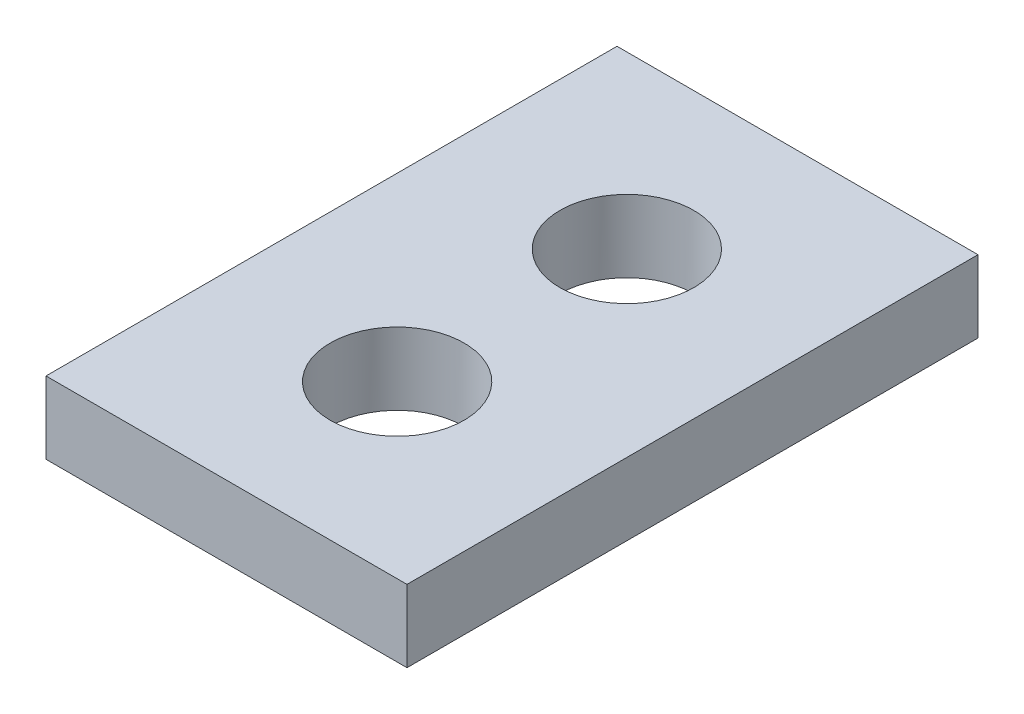
ISO-10303-21;
HEADER;
FILE_DESCRIPTION(('STEP AP214'),'2;1');
FILE_NAME('part.step','',(''),(''),'','','');
FILE_SCHEMA(('AUTOMOTIVE_DESIGN { 1 0 10303 214 1 1 1 1 }'));
ENDSEC;
DATA;
#1=APPLICATION_CONTEXT('core data for automotive mechanical design processes');
#2=APPLICATION_PROTOCOL_DEFINITION('international standard','automotive_design',2000,#1);
#3=PRODUCT_CONTEXT('',#1,'mechanical');
#4=PRODUCT('Part','Part','',(#3));
#5=PRODUCT_RELATED_PRODUCT_CATEGORY('part','',(#4));
#6=PRODUCT_DEFINITION_FORMATION('','',#4);
#7=PRODUCT_DEFINITION_CONTEXT('part definition',#1,'design');
#8=PRODUCT_DEFINITION('design','',#6,#7);
#9=PRODUCT_DEFINITION_SHAPE('','',#8);
#10=(LENGTH_UNIT() NAMED_UNIT(*) SI_UNIT(.MILLI.,.METRE.));
#11=(NAMED_UNIT(*) PLANE_ANGLE_UNIT() SI_UNIT($,.RADIAN.));
#12=(NAMED_UNIT(*) SI_UNIT($,.STERADIAN.) SOLID_ANGLE_UNIT());
#13=UNCERTAINTY_MEASURE_WITH_UNIT(LENGTH_MEASURE(1.E-05),#10,'distance_accuracy_value','');
#14=(GEOMETRIC_REPRESENTATION_CONTEXT(3) GLOBAL_UNCERTAINTY_ASSIGNED_CONTEXT((#13)) GLOBAL_UNIT_ASSIGNED_CONTEXT((#10,
#11,#12)) REPRESENTATION_CONTEXT('',''));
#15=CARTESIAN_POINT('',(0.,0.,0.));
#16=DIRECTION('',(0.,0.,1.));
#17=DIRECTION('',(1.,0.,0.));
#18=AXIS2_PLACEMENT_3D('',#15,#16,#17);
#19=CARTESIAN_POINT('',(6.875,2.75,10.875));
#20=DIRECTION('',(-1.,0.,0.));
#21=DIRECTION('',(0.,0.,1.));
#22=AXIS2_PLACEMENT_3D('',#19,#20,#21);
#23=PLANE('',#22);
#24=DIRECTION('',(0.,0.,-1.));
#25=VECTOR('',#24,1.);
#26=CARTESIAN_POINT('',(6.875,0.,10.875));
#27=LINE('',#26,#25);
#28=CARTESIAN_POINT('',(6.875,0.,10.875));
#29=VERTEX_POINT('',#28);
#30=CARTESIAN_POINT('',(6.875,0.,-10.875));
#31=VERTEX_POINT('',#30);
#32=EDGE_CURVE('E103',#29,#31,#27,.T.);
#33=ORIENTED_EDGE('',*,*,#32,.T.);
#34=DIRECTION('',(0.,-1.,0.));
#35=VECTOR('',#34,1.);
#36=CARTESIAN_POINT('',(6.875,2.75,-10.875));
#37=LINE('',#36,#35);
#38=CARTESIAN_POINT('',(6.875,2.75,-10.875));
#39=VERTEX_POINT('',#38);
#40=EDGE_CURVE('E11',#39,#31,#37,.T.);
#41=ORIENTED_EDGE('',*,*,#40,.F.);
#42=DIRECTION('',(0.,0.,-1.));
#43=VECTOR('',#42,1.);
#44=CARTESIAN_POINT('',(6.875,2.75,10.875));
#45=LINE('',#44,#43);
#46=CARTESIAN_POINT('',(6.875,2.75,10.875));
#47=VERTEX_POINT('',#46);
#48=EDGE_CURVE('E90',#47,#39,#45,.T.);
#49=ORIENTED_EDGE('',*,*,#48,.F.);
#50=DIRECTION('',(0.,-1.,0.));
#51=VECTOR('',#50,1.);
#52=CARTESIAN_POINT('',(6.875,2.75,10.875));
#53=LINE('',#52,#51);
#54=EDGE_CURVE('E99',#47,#29,#53,.T.);
#55=ORIENTED_EDGE('',*,*,#54,.T.);
#56=EDGE_LOOP('',(#33,#41,#49,#55));
#57=FACE_BOUND('',#56,.T.);
#58=ADVANCED_FACE('F37',(#57),#23,.F.);
#59=CARTESIAN_POINT('',(-6.875,2.75,-10.875));
#60=DIRECTION('',(0.,0.,1.));
#61=DIRECTION('',(1.,0.,0.));
#62=AXIS2_PLACEMENT_3D('',#59,#60,#61);
#63=PLANE('',#62);
#64=DIRECTION('',(-1.,0.,0.));
#65=VECTOR('',#64,1.);
#66=CARTESIAN_POINT('',(-6.875,0.,-10.875));
#67=LINE('',#66,#65);
#68=CARTESIAN_POINT('',(-6.875,0.,-10.875));
#69=VERTEX_POINT('',#68);
#70=EDGE_CURVE('E94',#31,#69,#67,.T.);
#71=ORIENTED_EDGE('',*,*,#70,.T.);
#72=DIRECTION('',(0.,-1.,0.));
#73=VECTOR('',#72,1.);
#74=CARTESIAN_POINT('',(-6.875,2.75,-10.875));
#75=LINE('',#74,#73);
#76=CARTESIAN_POINT('',(-6.875,2.75,-10.875));
#77=VERTEX_POINT('',#76);
#78=EDGE_CURVE('E46',#77,#69,#75,.T.);
#79=ORIENTED_EDGE('',*,*,#78,.F.);
#80=DIRECTION('',(-1.,0.,0.));
#81=VECTOR('',#80,1.);
#82=CARTESIAN_POINT('',(-6.875,2.75,-10.875));
#83=LINE('',#82,#81);
#84=EDGE_CURVE('E85',#39,#77,#83,.T.);
#85=ORIENTED_EDGE('',*,*,#84,.F.);
#86=ORIENTED_EDGE('',*,*,#40,.T.);
#87=EDGE_LOOP('',(#71,#79,#85,#86));
#88=FACE_BOUND('',#87,.T.);
#89=ADVANCED_FACE('F93',(#88),#63,.F.);
#90=CARTESIAN_POINT('',(-6.875,2.75,10.875));
#91=DIRECTION('',(1.,0.,0.));
#92=DIRECTION('',(0.,0.,-1.));
#93=AXIS2_PLACEMENT_3D('',#90,#91,#92);
#94=PLANE('',#93);
#95=DIRECTION('',(0.,0.,1.));
#96=VECTOR('',#95,1.);
#97=CARTESIAN_POINT('',(-6.875,0.,10.875));
#98=LINE('',#97,#96);
#99=CARTESIAN_POINT('',(-6.875,0.,10.875));
#100=VERTEX_POINT('',#99);
#101=EDGE_CURVE('E72',#69,#100,#98,.T.);
#102=ORIENTED_EDGE('',*,*,#101,.T.);
#103=DIRECTION('',(0.,-1.,0.));
#104=VECTOR('',#103,1.);
#105=CARTESIAN_POINT('',(-6.875,2.75,10.875));
#106=LINE('',#105,#104);
#107=CARTESIAN_POINT('',(-6.875,2.75,10.875));
#108=VERTEX_POINT('',#107);
#109=EDGE_CURVE('E95',#108,#100,#106,.T.);
#110=ORIENTED_EDGE('',*,*,#109,.F.);
#111=DIRECTION('',(0.,0.,1.));
#112=VECTOR('',#111,1.);
#113=CARTESIAN_POINT('',(-6.875,2.75,10.875));
#114=LINE('',#113,#112);
#115=EDGE_CURVE('E88',#77,#108,#114,.T.);
#116=ORIENTED_EDGE('',*,*,#115,.F.);
#117=ORIENTED_EDGE('',*,*,#78,.T.);
#118=EDGE_LOOP('',(#102,#110,#116,#117));
#119=FACE_BOUND('',#118,.T.);
#120=ADVANCED_FACE('F97',(#119),#94,.F.);
#121=CARTESIAN_POINT('',(-6.875,2.75,10.875));
#122=DIRECTION('',(0.,0.,-1.));
#123=DIRECTION('',(-1.,0.,0.));
#124=AXIS2_PLACEMENT_3D('',#121,#122,#123);
#125=PLANE('',#124);
#126=DIRECTION('',(1.,0.,0.));
#127=VECTOR('',#126,1.);
#128=CARTESIAN_POINT('',(-6.875,0.,10.875));
#129=LINE('',#128,#127);
#130=EDGE_CURVE('E78',#100,#29,#129,.T.);
#131=ORIENTED_EDGE('',*,*,#130,.T.);
#132=ORIENTED_EDGE('',*,*,#54,.F.);
#133=DIRECTION('',(1.,0.,0.));
#134=VECTOR('',#133,1.);
#135=CARTESIAN_POINT('',(-6.875,2.75,10.875));
#136=LINE('',#135,#134);
#137=EDGE_CURVE('E55',#108,#47,#136,.T.);
#138=ORIENTED_EDGE('',*,*,#137,.F.);
#139=ORIENTED_EDGE('',*,*,#109,.T.);
#140=EDGE_LOOP('',(#131,#132,#138,#139));
#141=FACE_BOUND('',#140,.T.);
#142=ADVANCED_FACE('F129',(#141),#125,.F.);
#143=CARTESIAN_POINT('',(0.,2.75,0.));
#144=DIRECTION('',(0.,-1.,0.));
#145=DIRECTION('',(0.,0.,-1.));
#146=AXIS2_PLACEMENT_3D('',#143,#144,#145);
#147=PLANE('',#146);
#148=CARTESIAN_POINT('',(0.,2.75,-4.375));
#149=DIRECTION('',(0.,1.,0.));
#150=DIRECTION('',(0.,0.,1.));
#151=AXIS2_PLACEMENT_3D('',#148,#149,#150);
#152=CIRCLE('',#151,2.55);
#153=CARTESIAN_POINT('',(0.,2.75,-1.825));
#154=VERTEX_POINT('',#153);
#155=EDGE_CURVE('E112',#154,#154,#152,.T.);
#156=ORIENTED_EDGE('',*,*,#155,.F.);
#157=EDGE_LOOP('',(#156));
#158=FACE_BOUND('',#157,.T.);
#159=CARTESIAN_POINT('',(0.,2.75,4.375));
#160=DIRECTION('',(0.,1.,0.));
#161=DIRECTION('',(0.,0.,1.));
#162=AXIS2_PLACEMENT_3D('',#159,#160,#161);
#163=CIRCLE('',#162,2.55);
#164=CARTESIAN_POINT('',(0.,2.75,6.925));
#165=VERTEX_POINT('',#164);
#166=EDGE_CURVE('E117',#165,#165,#163,.T.);
#167=ORIENTED_EDGE('',*,*,#166,.F.);
#168=EDGE_LOOP('',(#167));
#169=FACE_BOUND('',#168,.T.);
#170=ORIENTED_EDGE('',*,*,#48,.T.);
#171=ORIENTED_EDGE('',*,*,#84,.T.);
#172=ORIENTED_EDGE('',*,*,#115,.T.);
#173=ORIENTED_EDGE('',*,*,#137,.T.);
#174=EDGE_LOOP('',(#170,#171,#172,#173));
#175=FACE_BOUND('',#174,.T.);
#176=ADVANCED_FACE('F86',(#158,#169,#175),#147,.F.);
#177=CARTESIAN_POINT('',(0.,0.,0.));
#178=DIRECTION('',(0.,-1.,0.));
#179=DIRECTION('',(0.,0.,-1.));
#180=AXIS2_PLACEMENT_3D('',#177,#178,#179);
#181=PLANE('',#180);
#182=CARTESIAN_POINT('',(0.,0.,-4.375));
#183=DIRECTION('',(0.,-1.,0.));
#184=DIRECTION('',(0.,0.,-1.));
#185=AXIS2_PLACEMENT_3D('',#182,#183,#184);
#186=CIRCLE('',#185,2.55);
#187=CARTESIAN_POINT('',(0.,0.,-6.925));
#188=VERTEX_POINT('',#187);
#189=EDGE_CURVE('E40',#188,#188,#186,.T.);
#190=ORIENTED_EDGE('',*,*,#189,.F.);
#191=EDGE_LOOP('',(#190));
#192=FACE_BOUND('',#191,.T.);
#193=CARTESIAN_POINT('',(0.,0.,4.375));
#194=DIRECTION('',(0.,-1.,0.));
#195=DIRECTION('',(0.,0.,-1.));
#196=AXIS2_PLACEMENT_3D('',#193,#194,#195);
#197=CIRCLE('',#196,2.55);
#198=CARTESIAN_POINT('',(0.,0.,1.825));
#199=VERTEX_POINT('',#198);
#200=EDGE_CURVE('E110',#199,#199,#197,.T.);
#201=ORIENTED_EDGE('',*,*,#200,.F.);
#202=EDGE_LOOP('',(#201));
#203=FACE_BOUND('',#202,.T.);
#204=ORIENTED_EDGE('',*,*,#32,.F.);
#205=ORIENTED_EDGE('',*,*,#130,.F.);
#206=ORIENTED_EDGE('',*,*,#101,.F.);
#207=ORIENTED_EDGE('',*,*,#70,.F.);
#208=EDGE_LOOP('',(#204,#205,#206,#207));
#209=FACE_BOUND('',#208,.T.);
#210=ADVANCED_FACE('F128',(#192,#203,#209),#181,.T.);
#211=CARTESIAN_POINT('',(0.,-7.25,4.375));
#212=DIRECTION('',(0.,1.,0.));
#213=DIRECTION('',(0.,0.,1.));
#214=AXIS2_PLACEMENT_3D('',#211,#212,#213);
#215=CYLINDRICAL_SURFACE('',#214,2.55);
#216=ORIENTED_EDGE('',*,*,#200,.T.);
#217=EDGE_LOOP('',(#216));
#218=FACE_BOUND('',#217,.T.);
#219=ORIENTED_EDGE('',*,*,#166,.T.);
#220=EDGE_LOOP('',(#219));
#221=FACE_BOUND('',#220,.T.);
#222=ADVANCED_FACE('F125',(#218,#221),#215,.F.);
#223=CARTESIAN_POINT('',(0.,-7.25,-4.375));
#224=DIRECTION('',(0.,1.,0.));
#225=DIRECTION('',(0.,0.,1.));
#226=AXIS2_PLACEMENT_3D('',#223,#224,#225);
#227=CYLINDRICAL_SURFACE('',#226,2.55);
#228=ORIENTED_EDGE('',*,*,#189,.T.);
#229=EDGE_LOOP('',(#228));
#230=FACE_BOUND('',#229,.T.);
#231=ORIENTED_EDGE('',*,*,#155,.T.);
#232=EDGE_LOOP('',(#231));
#233=FACE_BOUND('',#232,.T.);
#234=ADVANCED_FACE('F176',(#230,#233),#227,.F.);
#235=CLOSED_SHELL('',(#58,#89,#120,#142,#176,#210,#222,#234));
#236=MANIFOLD_SOLID_BREP('B2',#235);
#237=ADVANCED_BREP_SHAPE_REPRESENTATION('',(#18,#236),#14);
#238=SHAPE_DEFINITION_REPRESENTATION(#9,#237);
ENDSEC;
END-ISO-10303-21;
